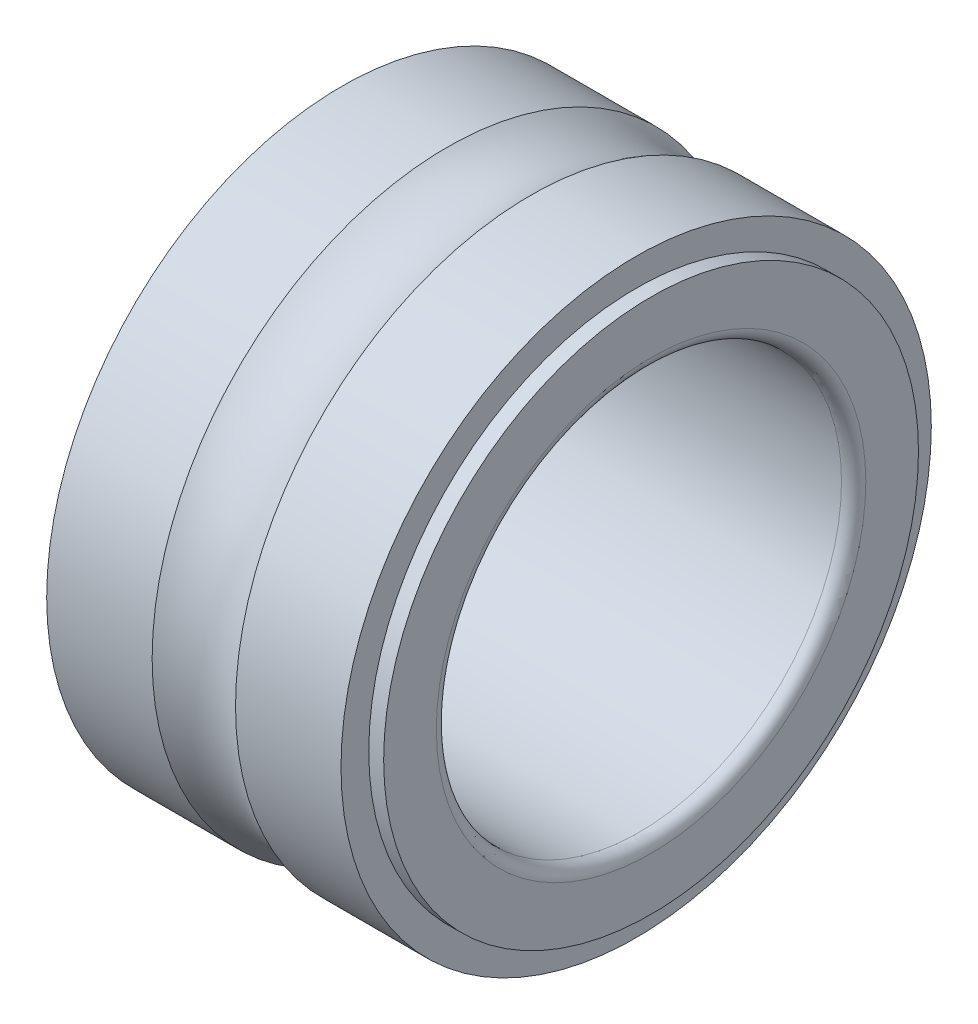
ISO-10303-21;
HEADER;
FILE_DESCRIPTION(('STEP AP214'),'2;1');
FILE_NAME('part.step','',(''),(''),'','','');
FILE_SCHEMA(('AUTOMOTIVE_DESIGN { 1 0 10303 214 1 1 1 1 }'));
ENDSEC;
DATA;
#1=APPLICATION_CONTEXT('core data for automotive mechanical design processes');
#2=APPLICATION_PROTOCOL_DEFINITION('international standard','automotive_design',2000,#1);
#3=PRODUCT_CONTEXT('',#1,'mechanical');
#4=PRODUCT('Part','Part','',(#3));
#5=PRODUCT_RELATED_PRODUCT_CATEGORY('part','',(#4));
#6=PRODUCT_DEFINITION_FORMATION('','',#4);
#7=PRODUCT_DEFINITION_CONTEXT('part definition',#1,'design');
#8=PRODUCT_DEFINITION('design','',#6,#7);
#9=PRODUCT_DEFINITION_SHAPE('','',#8);
#10=(LENGTH_UNIT() NAMED_UNIT(*) SI_UNIT(.MILLI.,.METRE.));
#11=(NAMED_UNIT(*) PLANE_ANGLE_UNIT() SI_UNIT($,.RADIAN.));
#12=(NAMED_UNIT(*) SI_UNIT($,.STERADIAN.) SOLID_ANGLE_UNIT());
#13=UNCERTAINTY_MEASURE_WITH_UNIT(LENGTH_MEASURE(1.E-05),#10,'distance_accuracy_value','');
#14=(GEOMETRIC_REPRESENTATION_CONTEXT(3) GLOBAL_UNCERTAINTY_ASSIGNED_CONTEXT((#13)) GLOBAL_UNIT_ASSIGNED_CONTEXT((#10,
#11,#12)) REPRESENTATION_CONTEXT('',''));
#15=CARTESIAN_POINT('',(0.,0.,0.));
#16=DIRECTION('',(0.,0.,1.));
#17=DIRECTION('',(1.,0.,0.));
#18=AXIS2_PLACEMENT_3D('',#15,#16,#17);
#19=CARTESIAN_POINT('',(4.,0.,0.));
#20=DIRECTION('',(1.,0.,0.));
#21=DIRECTION('',(0.,0.,-1.));
#22=AXIS2_PLACEMENT_3D('',#19,#20,#21);
#23=TOROIDAL_SURFACE('',#22,9.00000000000004,2.00000000000004);
#24=CARTESIAN_POINT('',(2.9710320704706,0.,0.));
#25=DIRECTION('',(1.,0.,0.));
#26=DIRECTION('',(0.,0.,-1.));
#27=AXIS2_PLACEMENT_3D('',#24,#25,#26);
#28=CIRCLE('',#27,7.285);
#29=CARTESIAN_POINT('',(2.9710320704706,0.,-7.285));
#30=VERTEX_POINT('',#29);
#31=EDGE_CURVE('E141',#30,#30,#28,.F.);
#32=ORIENTED_EDGE('',*,*,#31,.F.);
#33=EDGE_LOOP('',(#32));
#34=FACE_BOUND('',#33,.T.);
#35=CARTESIAN_POINT('',(5.0289679295294,0.,0.));
#36=DIRECTION('',(1.,0.,0.));
#37=DIRECTION('',(0.,0.,-1.));
#38=AXIS2_PLACEMENT_3D('',#35,#36,#37);
#39=CIRCLE('',#38,7.285);
#40=CARTESIAN_POINT('',(5.0289679295294,0.,-7.285));
#41=VERTEX_POINT('',#40);
#42=EDGE_CURVE('E145',#41,#41,#39,.T.);
#43=ORIENTED_EDGE('',*,*,#42,.F.);
#44=EDGE_LOOP('',(#43));
#45=FACE_BOUND('',#44,.T.);
#46=ADVANCED_FACE('F15',(#34,#45),#23,.F.);
#47=CARTESIAN_POINT('',(6.3304839647647,0.,0.));
#48=DIRECTION('',(1.,0.,0.));
#49=DIRECTION('',(0.,0.,-1.));
#50=AXIS2_PLACEMENT_3D('',#47,#48,#49);
#51=CYLINDRICAL_SURFACE('',#50,7.285);
#52=ORIENTED_EDGE('',*,*,#42,.T.);
#53=EDGE_LOOP('',(#52));
#54=FACE_BOUND('',#53,.T.);
#55=CARTESIAN_POINT('',(7.632,0.,0.));
#56=DIRECTION('',(1.,0.,0.));
#57=DIRECTION('',(0.,0.,-1.));
#58=AXIS2_PLACEMENT_3D('',#55,#56,#57);
#59=CIRCLE('',#58,7.285);
#60=CARTESIAN_POINT('',(7.632,0.,-7.285));
#61=VERTEX_POINT('',#60);
#62=EDGE_CURVE('E19',#61,#61,#59,.T.);
#63=ORIENTED_EDGE('',*,*,#62,.F.);
#64=EDGE_LOOP('',(#63));
#65=FACE_BOUND('',#64,.T.);
#66=ADVANCED_FACE('F96',(#54,#65),#51,.T.);
#67=CARTESIAN_POINT('',(1.6695160352353,0.,0.));
#68=DIRECTION('',(1.,0.,0.));
#69=DIRECTION('',(0.,0.,-1.));
#70=AXIS2_PLACEMENT_3D('',#67,#68,#69);
#71=CYLINDRICAL_SURFACE('',#70,7.285);
#72=CARTESIAN_POINT('',(0.368,0.,0.));
#73=DIRECTION('',(1.,0.,0.));
#74=DIRECTION('',(0.,0.,-1.));
#75=AXIS2_PLACEMENT_3D('',#72,#73,#74);
#76=CIRCLE('',#75,7.285);
#77=CARTESIAN_POINT('',(0.368,0.,-7.285));
#78=VERTEX_POINT('',#77);
#79=EDGE_CURVE('E136',#78,#78,#76,.F.);
#80=ORIENTED_EDGE('',*,*,#79,.F.);
#81=EDGE_LOOP('',(#80));
#82=FACE_BOUND('',#81,.T.);
#83=ORIENTED_EDGE('',*,*,#31,.T.);
#84=EDGE_LOOP('',(#83));
#85=FACE_BOUND('',#84,.T.);
#86=ADVANCED_FACE('F93',(#82,#85),#71,.T.);
#87=CARTESIAN_POINT('',(7.632,6.6,0.));
#88=DIRECTION('',(1.,0.,0.));
#89=DIRECTION('',(0.,0.,-1.));
#90=AXIS2_PLACEMENT_3D('',#87,#88,#89);
#91=PLANE('',#90);
#92=CARTESIAN_POINT('',(7.632,0.,0.));
#93=DIRECTION('',(1.,0.,0.));
#94=DIRECTION('',(0.,0.,-1.));
#95=AXIS2_PLACEMENT_3D('',#92,#93,#94);
#96=CIRCLE('',#95,6.6);
#97=CARTESIAN_POINT('',(7.632,0.,-6.6));
#98=VERTEX_POINT('',#97);
#99=EDGE_CURVE('E134',#98,#98,#96,.T.);
#100=ORIENTED_EDGE('',*,*,#99,.F.);
#101=EDGE_LOOP('',(#100));
#102=FACE_BOUND('',#101,.T.);
#103=ORIENTED_EDGE('',*,*,#62,.T.);
#104=EDGE_LOOP('',(#103));
#105=FACE_BOUND('',#104,.T.);
#106=ADVANCED_FACE('F89',(#102,#105),#91,.T.);
#107=CARTESIAN_POINT('',(0.368,7.285,0.));
#108=DIRECTION('',(-1.,0.,0.));
#109=DIRECTION('',(0.,0.,1.));
#110=AXIS2_PLACEMENT_3D('',#107,#108,#109);
#111=PLANE('',#110);
#112=CARTESIAN_POINT('',(0.368,0.,0.));
#113=DIRECTION('',(1.,0.,0.));
#114=DIRECTION('',(0.,0.,-1.));
#115=AXIS2_PLACEMENT_3D('',#112,#113,#114);
#116=CIRCLE('',#115,6.6);
#117=CARTESIAN_POINT('',(0.368,0.,-6.6));
#118=VERTEX_POINT('',#117);
#119=EDGE_CURVE('E127',#118,#118,#116,.F.);
#120=ORIENTED_EDGE('',*,*,#119,.F.);
#121=EDGE_LOOP('',(#120));
#122=FACE_BOUND('',#121,.T.);
#123=ORIENTED_EDGE('',*,*,#79,.T.);
#124=EDGE_LOOP('',(#123));
#125=FACE_BOUND('',#124,.T.);
#126=ADVANCED_FACE('F85',(#122,#125),#111,.T.);
#127=CARTESIAN_POINT('',(7.816,0.,0.));
#128=DIRECTION('',(1.,0.,0.));
#129=DIRECTION('',(0.,0.,-1.));
#130=AXIS2_PLACEMENT_3D('',#127,#128,#129);
#131=CYLINDRICAL_SURFACE('',#130,6.6);
#132=ORIENTED_EDGE('',*,*,#99,.T.);
#133=EDGE_LOOP('',(#132));
#134=FACE_BOUND('',#133,.T.);
#135=CARTESIAN_POINT('',(8.,0.,0.));
#136=DIRECTION('',(1.,0.,0.));
#137=DIRECTION('',(0.,0.,-1.));
#138=AXIS2_PLACEMENT_3D('',#135,#136,#137);
#139=CIRCLE('',#138,6.6);
#140=CARTESIAN_POINT('',(8.,0.,-6.6));
#141=VERTEX_POINT('',#140);
#142=EDGE_CURVE('E122',#141,#141,#139,.T.);
#143=ORIENTED_EDGE('',*,*,#142,.F.);
#144=EDGE_LOOP('',(#143));
#145=FACE_BOUND('',#144,.T.);
#146=ADVANCED_FACE('F81',(#134,#145),#131,.T.);
#147=CARTESIAN_POINT('',(0.184,0.,0.));
#148=DIRECTION('',(1.,0.,0.));
#149=DIRECTION('',(0.,0.,-1.));
#150=AXIS2_PLACEMENT_3D('',#147,#148,#149);
#151=CYLINDRICAL_SURFACE('',#150,6.6);
#152=CARTESIAN_POINT('',(0.,0.,0.));
#153=DIRECTION('',(1.,0.,0.));
#154=DIRECTION('',(0.,0.,-1.));
#155=AXIS2_PLACEMENT_3D('',#152,#153,#154);
#156=CIRCLE('',#155,6.6);
#157=CARTESIAN_POINT('',(0.,0.,-6.6));
#158=VERTEX_POINT('',#157);
#159=EDGE_CURVE('E120',#158,#158,#156,.F.);
#160=ORIENTED_EDGE('',*,*,#159,.F.);
#161=EDGE_LOOP('',(#160));
#162=FACE_BOUND('',#161,.T.);
#163=ORIENTED_EDGE('',*,*,#119,.T.);
#164=EDGE_LOOP('',(#163));
#165=FACE_BOUND('',#164,.T.);
#166=ADVANCED_FACE('F77',(#162,#165),#151,.T.);
#167=CARTESIAN_POINT('',(8.,5.3,0.));
#168=DIRECTION('',(1.,0.,0.));
#169=DIRECTION('',(0.,0.,-1.));
#170=AXIS2_PLACEMENT_3D('',#167,#168,#169);
#171=PLANE('',#170);
#172=CARTESIAN_POINT('',(8.,0.,0.));
#173=DIRECTION('',(1.,0.,0.));
#174=DIRECTION('',(0.,0.,1.));
#175=AXIS2_PLACEMENT_3D('',#172,#173,#174);
#176=CIRCLE('',#175,5.3);
#177=CARTESIAN_POINT('',(8.,0.,5.3));
#178=VERTEX_POINT('',#177);
#179=EDGE_CURVE('E61',#178,#178,#176,.T.);
#180=ORIENTED_EDGE('',*,*,#179,.F.);
#181=EDGE_LOOP('',(#180));
#182=FACE_BOUND('',#181,.T.);
#183=ORIENTED_EDGE('',*,*,#142,.T.);
#184=EDGE_LOOP('',(#183));
#185=FACE_BOUND('',#184,.T.);
#186=ADVANCED_FACE('F67',(#182,#185),#171,.T.);
#187=CARTESIAN_POINT('',(0.,6.6,0.));
#188=DIRECTION('',(-1.,0.,0.));
#189=DIRECTION('',(0.,0.,1.));
#190=AXIS2_PLACEMENT_3D('',#187,#188,#189);
#191=PLANE('',#190);
#192=CARTESIAN_POINT('',(0.,0.,0.));
#193=DIRECTION('',(-1.,0.,0.));
#194=DIRECTION('',(0.,0.,1.));
#195=AXIS2_PLACEMENT_3D('',#192,#193,#194);
#196=CIRCLE('',#195,5.3);
#197=CARTESIAN_POINT('',(0.,0.,5.3));
#198=VERTEX_POINT('',#197);
#199=EDGE_CURVE('E28',#198,#198,#196,.T.);
#200=ORIENTED_EDGE('',*,*,#199,.F.);
#201=EDGE_LOOP('',(#200));
#202=FACE_BOUND('',#201,.T.);
#203=ORIENTED_EDGE('',*,*,#159,.T.);
#204=EDGE_LOOP('',(#203));
#205=FACE_BOUND('',#204,.T.);
#206=ADVANCED_FACE('F76',(#202,#205),#191,.T.);
#207=CARTESIAN_POINT('',(7.70000000000012,0.,0.));
#208=DIRECTION('',(1.,0.,0.));
#209=DIRECTION('',(0.,0.,-1.));
#210=AXIS2_PLACEMENT_3D('',#207,#208,#209);
#211=TOROIDAL_SURFACE('',#210,5.29999999999988,0.299999999999876);
#212=ORIENTED_EDGE('',*,*,#179,.T.);
#213=EDGE_LOOP('',(#212));
#214=FACE_BOUND('',#213,.T.);
#215=CARTESIAN_POINT('',(7.7,0.,0.));
#216=DIRECTION('',(1.,0.,0.));
#217=DIRECTION('',(0.,0.,-1.));
#218=AXIS2_PLACEMENT_3D('',#215,#216,#217);
#219=CIRCLE('',#218,5.);
#220=CARTESIAN_POINT('',(7.7,0.,-5.));
#221=VERTEX_POINT('',#220);
#222=EDGE_CURVE('E23',#221,#221,#219,.F.);
#223=ORIENTED_EDGE('',*,*,#222,.T.);
#224=EDGE_LOOP('',(#223));
#225=FACE_BOUND('',#224,.T.);
#226=ADVANCED_FACE('F42',(#214,#225),#211,.T.);
#227=CARTESIAN_POINT('',(0.299999999999939,0.,0.));
#228=DIRECTION('',(1.,0.,0.));
#229=DIRECTION('',(0.,0.,-1.));
#230=AXIS2_PLACEMENT_3D('',#227,#228,#229);
#231=TOROIDAL_SURFACE('',#230,5.29999999999994,0.299999999999939);
#232=CARTESIAN_POINT('',(0.3,0.,0.));
#233=DIRECTION('',(1.,0.,0.));
#234=DIRECTION('',(0.,0.,-1.));
#235=AXIS2_PLACEMENT_3D('',#232,#233,#234);
#236=CIRCLE('',#235,5.);
#237=CARTESIAN_POINT('',(0.3,0.,-5.));
#238=VERTEX_POINT('',#237);
#239=EDGE_CURVE('E10',#238,#238,#236,.T.);
#240=ORIENTED_EDGE('',*,*,#239,.T.);
#241=EDGE_LOOP('',(#240));
#242=FACE_BOUND('',#241,.T.);
#243=ORIENTED_EDGE('',*,*,#199,.T.);
#244=EDGE_LOOP('',(#243));
#245=FACE_BOUND('',#244,.T.);
#246=ADVANCED_FACE('F36',(#242,#245),#231,.T.);
#247=CARTESIAN_POINT('',(4.,0.,0.));
#248=DIRECTION('',(1.,0.,0.));
#249=DIRECTION('',(0.,0.,-1.));
#250=AXIS2_PLACEMENT_3D('',#247,#248,#249);
#251=CYLINDRICAL_SURFACE('',#250,5.);
#252=ORIENTED_EDGE('',*,*,#222,.F.);
#253=EDGE_LOOP('',(#252));
#254=FACE_BOUND('',#253,.T.);
#255=ORIENTED_EDGE('',*,*,#239,.F.);
#256=EDGE_LOOP('',(#255));
#257=FACE_BOUND('',#256,.T.);
#258=ADVANCED_FACE('F41',(#254,#257),#251,.F.);
#259=CLOSED_SHELL('',(#46,#66,#86,#106,#126,#146,#166,#186,#206,#226,#246,#258));
#260=MANIFOLD_SOLID_BREP('B1',#259);
#261=ADVANCED_BREP_SHAPE_REPRESENTATION('',(#18,#260),#14);
#262=SHAPE_DEFINITION_REPRESENTATION(#9,#261);
ENDSEC;
END-ISO-10303-21;
